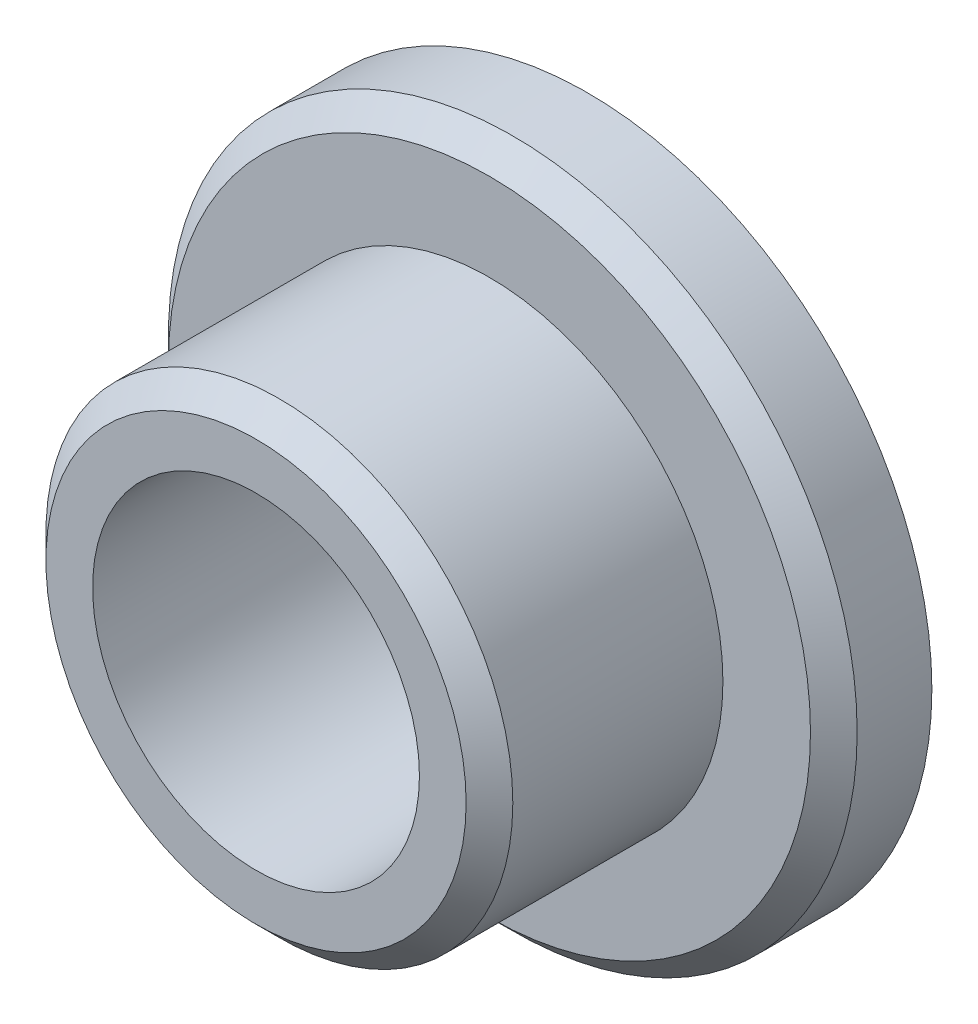
ISO-10303-21;
HEADER;
FILE_DESCRIPTION(('STEP AP214'),'2;1');
FILE_NAME('part.step','',(''),(''),'','','');
FILE_SCHEMA(('AUTOMOTIVE_DESIGN { 1 0 10303 214 1 1 1 1 }'));
ENDSEC;
DATA;
#1=APPLICATION_CONTEXT('core data for automotive mechanical design processes');
#2=APPLICATION_PROTOCOL_DEFINITION('international standard','automotive_design',2000,#1);
#3=PRODUCT_CONTEXT('',#1,'mechanical');
#4=PRODUCT('Part','Part','',(#3));
#5=PRODUCT_RELATED_PRODUCT_CATEGORY('part','',(#4));
#6=PRODUCT_DEFINITION_FORMATION('','',#4);
#7=PRODUCT_DEFINITION_CONTEXT('part definition',#1,'design');
#8=PRODUCT_DEFINITION('design','',#6,#7);
#9=PRODUCT_DEFINITION_SHAPE('','',#8);
#10=(LENGTH_UNIT() NAMED_UNIT(*) SI_UNIT(.MILLI.,.METRE.));
#11=(NAMED_UNIT(*) PLANE_ANGLE_UNIT() SI_UNIT($,.RADIAN.));
#12=(NAMED_UNIT(*) SI_UNIT($,.STERADIAN.) SOLID_ANGLE_UNIT());
#13=UNCERTAINTY_MEASURE_WITH_UNIT(LENGTH_MEASURE(1.E-05),#10,'distance_accuracy_value','');
#14=(GEOMETRIC_REPRESENTATION_CONTEXT(3) GLOBAL_UNCERTAINTY_ASSIGNED_CONTEXT((#13)) GLOBAL_UNIT_ASSIGNED_CONTEXT((#10,
#11,#12)) REPRESENTATION_CONTEXT('',''));
#15=CARTESIAN_POINT('',(0.,0.,0.));
#16=DIRECTION('',(0.,0.,1.));
#17=DIRECTION('',(1.,0.,0.));
#18=AXIS2_PLACEMENT_3D('',#15,#16,#17);
#19=CARTESIAN_POINT('',(0.,0.,4.2));
#20=DIRECTION('',(0.,0.,-1.));
#21=DIRECTION('',(-1.,0.,0.));
#22=AXIS2_PLACEMENT_3D('',#19,#20,#21);
#23=CYLINDRICAL_SURFACE('',#22,14.75);
#24=CARTESIAN_POINT('',(0.,0.,3.19999999999999));
#25=DIRECTION('',(0.,0.,1.));
#26=DIRECTION('',(1.,0.,0.));
#27=AXIS2_PLACEMENT_3D('',#24,#25,#26);
#28=CIRCLE('',#27,14.75);
#29=CARTESIAN_POINT('',(14.75,0.,3.19999999999999));
#30=VERTEX_POINT('',#29);
#31=EDGE_CURVE('E10',#30,#30,#28,.F.);
#32=ORIENTED_EDGE('',*,*,#31,.T.);
#33=EDGE_LOOP('',(#32));
#34=FACE_BOUND('',#33,.T.);
#35=CARTESIAN_POINT('',(0.,0.,0.));
#36=DIRECTION('',(0.,0.,1.));
#37=DIRECTION('',(1.,0.,0.));
#38=AXIS2_PLACEMENT_3D('',#35,#36,#37);
#39=CIRCLE('',#38,14.75);
#40=CARTESIAN_POINT('',(14.75,0.,0.));
#41=VERTEX_POINT('',#40);
#42=EDGE_CURVE('E61',#41,#41,#39,.T.);
#43=ORIENTED_EDGE('',*,*,#42,.T.);
#44=EDGE_LOOP('',(#43));
#45=FACE_BOUND('',#44,.T.);
#46=ADVANCED_FACE('F36',(#34,#45),#23,.T.);
#47=CARTESIAN_POINT('',(0.,0.,4.2));
#48=DIRECTION('',(0.,0.,1.));
#49=DIRECTION('',(1.,0.,0.));
#50=AXIS2_PLACEMENT_3D('',#47,#48,#49);
#51=PLANE('',#50);
#52=CARTESIAN_POINT('',(0.,0.,4.2));
#53=DIRECTION('',(0.,0.,1.));
#54=DIRECTION('',(1.,0.,0.));
#55=AXIS2_PLACEMENT_3D('',#52,#53,#54);
#56=CIRCLE('',#55,13.75);
#57=CARTESIAN_POINT('',(13.75,0.,4.2));
#58=VERTEX_POINT('',#57);
#59=EDGE_CURVE('E44',#58,#58,#56,.T.);
#60=ORIENTED_EDGE('',*,*,#59,.T.);
#61=EDGE_LOOP('',(#60));
#62=FACE_BOUND('',#61,.T.);
#63=CARTESIAN_POINT('',(0.,0.,4.2));
#64=DIRECTION('',(0.,0.,1.));
#65=DIRECTION('',(1.,0.,0.));
#66=AXIS2_PLACEMENT_3D('',#63,#64,#65);
#67=CIRCLE('',#66,10.);
#68=CARTESIAN_POINT('',(10.,0.,4.2));
#69=VERTEX_POINT('',#68);
#70=EDGE_CURVE('E60',#69,#69,#67,.T.);
#71=ORIENTED_EDGE('',*,*,#70,.F.);
#72=EDGE_LOOP('',(#71));
#73=FACE_BOUND('',#72,.T.);
#74=ADVANCED_FACE('F99',(#62,#73),#51,.T.);
#75=CARTESIAN_POINT('',(0.,0.,0.));
#76=DIRECTION('',(0.,0.,1.));
#77=DIRECTION('',(1.,0.,0.));
#78=AXIS2_PLACEMENT_3D('',#75,#76,#77);
#79=PLANE('',#78);
#80=CARTESIAN_POINT('',(0.,0.,0.));
#81=DIRECTION('',(0.,0.,1.));
#82=DIRECTION('',(1.,0.,0.));
#83=AXIS2_PLACEMENT_3D('',#80,#81,#82);
#84=CIRCLE('',#83,7.);
#85=CARTESIAN_POINT('',(7.,0.,0.));
#86=VERTEX_POINT('',#85);
#87=EDGE_CURVE('E65',#86,#86,#84,.T.);
#88=ORIENTED_EDGE('',*,*,#87,.T.);
#89=EDGE_LOOP('',(#88));
#90=FACE_BOUND('',#89,.T.);
#91=ORIENTED_EDGE('',*,*,#42,.F.);
#92=EDGE_LOOP('',(#91));
#93=FACE_BOUND('',#92,.T.);
#94=ADVANCED_FACE('F77',(#90,#93),#79,.F.);
#95=CARTESIAN_POINT('',(0.,0.,14.2));
#96=DIRECTION('',(0.,0.,-1.));
#97=DIRECTION('',(-1.,0.,0.));
#98=AXIS2_PLACEMENT_3D('',#95,#96,#97);
#99=CYLINDRICAL_SURFACE('',#98,10.);
#100=CARTESIAN_POINT('',(0.,0.,13.2));
#101=DIRECTION('',(0.,0.,1.));
#102=DIRECTION('',(1.,0.,0.));
#103=AXIS2_PLACEMENT_3D('',#100,#101,#102);
#104=CIRCLE('',#103,10.);
#105=CARTESIAN_POINT('',(10.,0.,13.2));
#106=VERTEX_POINT('',#105);
#107=EDGE_CURVE('E49',#106,#106,#104,.F.);
#108=ORIENTED_EDGE('',*,*,#107,.T.);
#109=EDGE_LOOP('',(#108));
#110=FACE_BOUND('',#109,.T.);
#111=ORIENTED_EDGE('',*,*,#70,.T.);
#112=EDGE_LOOP('',(#111));
#113=FACE_BOUND('',#112,.T.);
#114=ADVANCED_FACE('F89',(#110,#113),#99,.T.);
#115=CARTESIAN_POINT('',(0.,0.,14.2));
#116=DIRECTION('',(0.,0.,1.));
#117=DIRECTION('',(1.,0.,0.));
#118=AXIS2_PLACEMENT_3D('',#115,#116,#117);
#119=PLANE('',#118);
#120=CARTESIAN_POINT('',(0.,0.,14.2));
#121=DIRECTION('',(0.,0.,1.));
#122=DIRECTION('',(1.,0.,0.));
#123=AXIS2_PLACEMENT_3D('',#120,#121,#122);
#124=CIRCLE('',#123,8.99999999999999);
#125=CARTESIAN_POINT('',(8.99999999999999,0.,14.2));
#126=VERTEX_POINT('',#125);
#127=EDGE_CURVE('E54',#126,#126,#124,.T.);
#128=ORIENTED_EDGE('',*,*,#127,.T.);
#129=EDGE_LOOP('',(#128));
#130=FACE_BOUND('',#129,.T.);
#131=CARTESIAN_POINT('',(0.,0.,14.2));
#132=DIRECTION('',(0.,0.,1.));
#133=DIRECTION('',(1.,0.,0.));
#134=AXIS2_PLACEMENT_3D('',#131,#132,#133);
#135=CIRCLE('',#134,7.);
#136=CARTESIAN_POINT('',(7.,0.,14.2));
#137=VERTEX_POINT('',#136);
#138=EDGE_CURVE('E69',#137,#137,#135,.T.);
#139=ORIENTED_EDGE('',*,*,#138,.F.);
#140=EDGE_LOOP('',(#139));
#141=FACE_BOUND('',#140,.T.);
#142=ADVANCED_FACE('F84',(#130,#141),#119,.T.);
#143=CARTESIAN_POINT('',(0.,0.,0.));
#144=DIRECTION('',(0.,0.,1.));
#145=DIRECTION('',(1.,0.,0.));
#146=AXIS2_PLACEMENT_3D('',#143,#144,#145);
#147=CYLINDRICAL_SURFACE('',#146,7.);
#148=ORIENTED_EDGE('',*,*,#87,.F.);
#149=EDGE_LOOP('',(#148));
#150=FACE_BOUND('',#149,.T.);
#151=ORIENTED_EDGE('',*,*,#138,.T.);
#152=EDGE_LOOP('',(#151));
#153=FACE_BOUND('',#152,.T.);
#154=ADVANCED_FACE('F80',(#150,#153),#147,.F.);
#155=CARTESIAN_POINT('',(0.,0.,14.2));
#156=DIRECTION('',(0.,0.,-1.));
#157=DIRECTION('',(-1.,0.,0.));
#158=AXIS2_PLACEMENT_3D('',#155,#156,#157);
#159=CONICAL_SURFACE('',#158,8.99999999999999,0.785398163397445);
#160=ORIENTED_EDGE('',*,*,#107,.F.);
#161=EDGE_LOOP('',(#160));
#162=FACE_BOUND('',#161,.T.);
#163=ORIENTED_EDGE('',*,*,#127,.F.);
#164=EDGE_LOOP('',(#163));
#165=FACE_BOUND('',#164,.T.);
#166=ADVANCED_FACE('F83',(#162,#165),#159,.T.);
#167=CARTESIAN_POINT('',(0.,0.,4.2));
#168=DIRECTION('',(0.,0.,-1.));
#169=DIRECTION('',(-1.,0.,0.));
#170=AXIS2_PLACEMENT_3D('',#167,#168,#169);
#171=CONICAL_SURFACE('',#170,13.75,0.785398163397443);
#172=ORIENTED_EDGE('',*,*,#31,.F.);
#173=EDGE_LOOP('',(#172));
#174=FACE_BOUND('',#173,.T.);
#175=ORIENTED_EDGE('',*,*,#59,.F.);
#176=EDGE_LOOP('',(#175));
#177=FACE_BOUND('',#176,.T.);
#178=ADVANCED_FACE('F38',(#174,#177),#171,.T.);
#179=CLOSED_SHELL('',(#46,#74,#94,#114,#142,#154,#166,#178));
#180=MANIFOLD_SOLID_BREP('B2',#179);
#181=ADVANCED_BREP_SHAPE_REPRESENTATION('',(#18,#180),#14);
#182=SHAPE_DEFINITION_REPRESENTATION(#9,#181);
ENDSEC;
END-ISO-10303-21;
